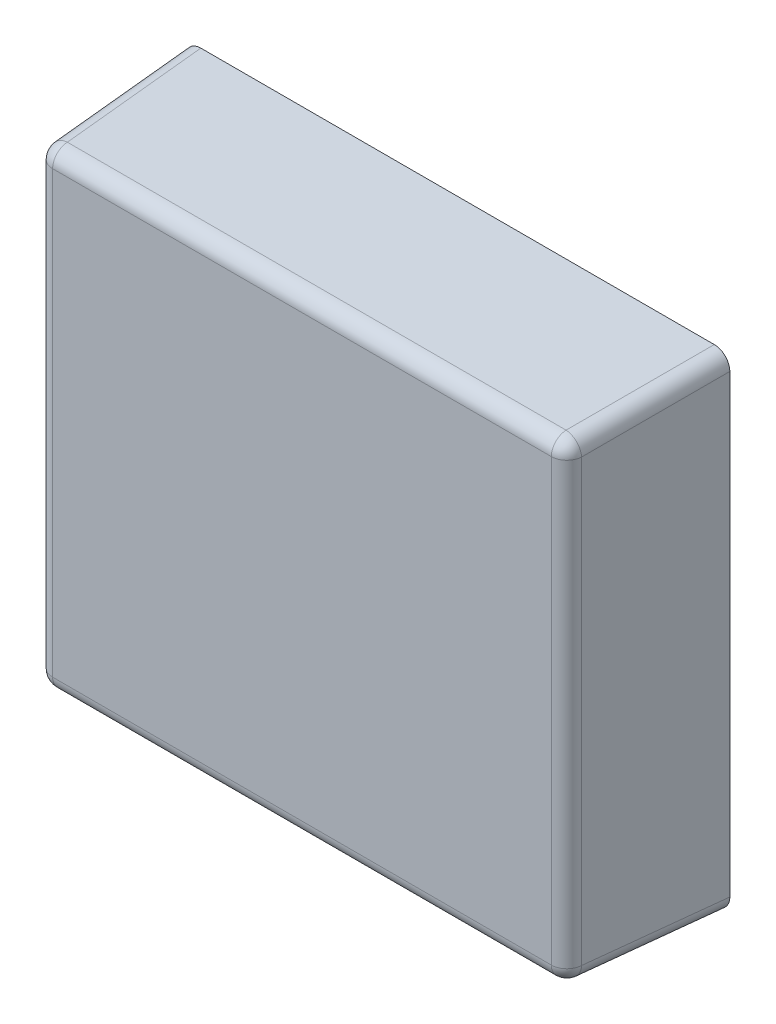
ISO-10303-21;
HEADER;
FILE_DESCRIPTION(('STEP AP214'),'2;1');
FILE_NAME('part.step','',(''),(''),'','','');
FILE_SCHEMA(('AUTOMOTIVE_DESIGN { 1 0 10303 214 1 1 1 1 }'));
ENDSEC;
DATA;
#1=APPLICATION_CONTEXT('core data for automotive mechanical design processes');
#2=APPLICATION_PROTOCOL_DEFINITION('international standard','automotive_design',2000,#1);
#3=PRODUCT_CONTEXT('',#1,'mechanical');
#4=PRODUCT('Part','Part','',(#3));
#5=PRODUCT_RELATED_PRODUCT_CATEGORY('part','',(#4));
#6=PRODUCT_DEFINITION_FORMATION('','',#4);
#7=PRODUCT_DEFINITION_CONTEXT('part definition',#1,'design');
#8=PRODUCT_DEFINITION('design','',#6,#7);
#9=PRODUCT_DEFINITION_SHAPE('','',#8);
#10=(LENGTH_UNIT() NAMED_UNIT(*) SI_UNIT(.MILLI.,.METRE.));
#11=(NAMED_UNIT(*) PLANE_ANGLE_UNIT() SI_UNIT($,.RADIAN.));
#12=(NAMED_UNIT(*) SI_UNIT($,.STERADIAN.) SOLID_ANGLE_UNIT());
#13=UNCERTAINTY_MEASURE_WITH_UNIT(LENGTH_MEASURE(1.E-05),#10,'distance_accuracy_value','');
#14=(GEOMETRIC_REPRESENTATION_CONTEXT(3) GLOBAL_UNCERTAINTY_ASSIGNED_CONTEXT((#13)) GLOBAL_UNIT_ASSIGNED_CONTEXT((#10,
#11,#12)) REPRESENTATION_CONTEXT('',''));
#15=CARTESIAN_POINT('',(0.,0.,0.));
#16=DIRECTION('',(0.,0.,1.));
#17=DIRECTION('',(1.,0.,0.));
#18=AXIS2_PLACEMENT_3D('',#15,#16,#17);
#19=CARTESIAN_POINT('',(-0.7,-0.625,0.4));
#20=DIRECTION('',(0.,0.,1.));
#21=DIRECTION('',(1.,0.,0.));
#22=AXIS2_PLACEMENT_3D('',#19,#20,#21);
#23=PLANE('',#22);
#24=DIRECTION('',(0.,1.,0.));
#25=VECTOR('',#24,1.);
#26=CARTESIAN_POINT('',(-0.641078305618,-0.625,0.4));
#27=LINE('',#26,#25);
#28=CARTESIAN_POINT('',(-0.641078305618,-0.566078305618,0.4));
#29=VERTEX_POINT('',#28);
#30=CARTESIAN_POINT('',(-0.641078305618,0.566078305618,0.4));
#31=VERTEX_POINT('',#30);
#32=EDGE_CURVE('E98',#29,#31,#27,.T.);
#33=ORIENTED_EDGE('',*,*,#32,.F.);
#34=DIRECTION('',(-1.,0.,0.));
#35=VECTOR('',#34,1.);
#36=CARTESIAN_POINT('',(-0.7,-0.566078305618,0.4));
#37=LINE('',#36,#35);
#38=CARTESIAN_POINT('',(0.641078305618,-0.566078305618,0.4));
#39=VERTEX_POINT('',#38);
#40=EDGE_CURVE('E100',#39,#29,#37,.T.);
#41=ORIENTED_EDGE('',*,*,#40,.F.);
#42=DIRECTION('',(0.,-1.,0.));
#43=VECTOR('',#42,1.);
#44=CARTESIAN_POINT('',(0.641078305618,-0.625,0.4));
#45=LINE('',#44,#43);
#46=CARTESIAN_POINT('',(0.641078305618,0.566078305618,0.4));
#47=VERTEX_POINT('',#46);
#48=EDGE_CURVE('E92',#47,#39,#45,.T.);
#49=ORIENTED_EDGE('',*,*,#48,.F.);
#50=DIRECTION('',(1.,0.,0.));
#51=VECTOR('',#50,1.);
#52=CARTESIAN_POINT('',(-0.7,0.566078305618,0.4));
#53=LINE('',#52,#51);
#54=EDGE_CURVE('E102',#31,#47,#53,.T.);
#55=ORIENTED_EDGE('',*,*,#54,.F.);
#56=EDGE_LOOP('',(#33,#41,#49,#55));
#57=FACE_BOUND('',#56,.T.);
#58=ADVANCED_FACE('F16',(#57),#23,.T.);
#59=CARTESIAN_POINT('',(-0.641078305618,0.566078305618,0.36));
#60=DIRECTION('',(1.,0.,0.));
#61=DIRECTION('',(0.,1.,0.));
#62=AXIS2_PLACEMENT_3D('',#59,#60,#61);
#63=SPHERICAL_SURFACE('',#62,0.04);
#64=CARTESIAN_POINT('',(-0.641078305618,0.566078305618,0.36));
#65=DIRECTION('',(0.,1.,0.));
#66=DIRECTION('',(0.,0.,1.));
#67=AXIS2_PLACEMENT_3D('',#64,#65,#66);
#68=CIRCLE('',#67,0.04);
#69=CARTESIAN_POINT('',(-0.681023487008266,0.566078305618001,0.362093438250014));
#70=VERTEX_POINT('',#69);
#71=EDGE_CURVE('E83',#31,#70,#68,.F.);
#72=ORIENTED_EDGE('',*,*,#71,.F.);
#73=CARTESIAN_POINT('',(-0.641078305618,0.566078305618,0.36));
#74=DIRECTION('',(1.,0.,0.));
#75=DIRECTION('',(0.,1.,0.));
#76=AXIS2_PLACEMENT_3D('',#73,#74,#75);
#77=CIRCLE('',#76,0.04);
#78=CARTESIAN_POINT('',(-0.641078305618,0.606023487008274,0.362093438250014));
#79=VERTEX_POINT('',#78);
#80=EDGE_CURVE('E152',#79,#31,#77,.T.);
#81=ORIENTED_EDGE('',*,*,#80,.F.);
#82=CARTESIAN_POINT('',(-0.641078305618197,0.566078305618197,0.360000000000312));
#83=DIRECTION('',(0.0522644276887224,-0.0522644276887224,0.997264688634236));
#84=DIRECTION('',(0.998629534754573,0.,-0.0523359562429523));
#85=AXIS2_PLACEMENT_3D('',#82,#83,#84);
#86=CIRCLE('',#85,0.04);
#87=EDGE_CURVE('E19',#70,#79,#86,.F.);
#88=ORIENTED_EDGE('',*,*,#87,.F.);
#89=EDGE_LOOP('',(#72,#81,#88));
#90=FACE_BOUND('',#89,.T.);
#91=ADVANCED_FACE('F141',(#90),#63,.T.);
#92=CARTESIAN_POINT('',(-0.641078305618,-0.625,0.36));
#93=DIRECTION('',(0.,1.,0.));
#94=DIRECTION('',(0.,0.,1.));
#95=AXIS2_PLACEMENT_3D('',#92,#93,#94);
#96=CYLINDRICAL_SURFACE('',#95,0.04);
#97=ORIENTED_EDGE('',*,*,#71,.T.);
#98=DIRECTION('',(0.,1.,0.));
#99=VECTOR('',#98,1.);
#100=CARTESIAN_POINT('',(-0.681023487008365,0.,0.362093438250019));
#101=LINE('',#100,#99);
#102=CARTESIAN_POINT('',(-0.681023487008335,-0.566078305618,0.362093438250017));
#103=VERTEX_POINT('',#102);
#104=EDGE_CURVE('E107',#103,#70,#101,.T.);
#105=ORIENTED_EDGE('',*,*,#104,.F.);
#106=CARTESIAN_POINT('',(-0.641078305618,-0.566078305618,0.36));
#107=DIRECTION('',(0.,-1.,0.));
#108=DIRECTION('',(1.,0.,0.));
#109=AXIS2_PLACEMENT_3D('',#106,#107,#108);
#110=CIRCLE('',#109,0.04);
#111=EDGE_CURVE('E105',#29,#103,#110,.T.);
#112=ORIENTED_EDGE('',*,*,#111,.F.);
#113=ORIENTED_EDGE('',*,*,#32,.T.);
#114=EDGE_LOOP('',(#97,#105,#112,#113));
#115=FACE_BOUND('',#114,.T.);
#116=ADVANCED_FACE('F106',(#115),#96,.T.);
#117=CARTESIAN_POINT('',(-0.641078305618,-0.566078305618,0.36));
#118=DIRECTION('',(1.,0.,0.));
#119=DIRECTION('',(0.,1.,0.));
#120=AXIS2_PLACEMENT_3D('',#117,#118,#119);
#121=SPHERICAL_SURFACE('',#120,0.04);
#122=CARTESIAN_POINT('',(-0.641078305618319,-0.566078305618319,0.360000000000325));
#123=DIRECTION('',(0.0522644276887224,0.0522644276887224,0.997264688634236));
#124=DIRECTION('',(0.998629534754573,0.,-0.0523359562429523));
#125=AXIS2_PLACEMENT_3D('',#122,#123,#124);
#126=CIRCLE('',#125,0.04);
#127=CARTESIAN_POINT('',(-0.641078305618002,-0.606023487008266,0.362093438250014));
#128=VERTEX_POINT('',#127);
#129=EDGE_CURVE('E122',#128,#103,#126,.F.);
#130=ORIENTED_EDGE('',*,*,#129,.F.);
#131=CARTESIAN_POINT('',(-0.641078305618,-0.566078305618,0.36));
#132=DIRECTION('',(-1.,0.,0.));
#133=DIRECTION('',(0.,-1.,0.));
#134=AXIS2_PLACEMENT_3D('',#131,#132,#133);
#135=CIRCLE('',#134,0.04);
#136=EDGE_CURVE('E113',#29,#128,#135,.F.);
#137=ORIENTED_EDGE('',*,*,#136,.F.);
#138=ORIENTED_EDGE('',*,*,#111,.T.);
#139=EDGE_LOOP('',(#130,#137,#138));
#140=FACE_BOUND('',#139,.T.);
#141=ADVANCED_FACE('F121',(#140),#121,.T.);
#142=CARTESIAN_POINT('',(-0.7,-0.566078305618,0.36));
#143=DIRECTION('',(-1.,0.,0.));
#144=DIRECTION('',(0.,-1.,0.));
#145=AXIS2_PLACEMENT_3D('',#142,#143,#144);
#146=CYLINDRICAL_SURFACE('',#145,0.04);
#147=CARTESIAN_POINT('',(0.641078305618,-0.566078305618,0.36));
#148=DIRECTION('',(1.,0.,0.));
#149=DIRECTION('',(0.,1.,0.));
#150=AXIS2_PLACEMENT_3D('',#147,#148,#149);
#151=CIRCLE('',#150,0.04);
#152=CARTESIAN_POINT('',(0.641078305618,-0.606023487008274,0.362093438250014));
#153=VERTEX_POINT('',#152);
#154=EDGE_CURVE('E119',#39,#153,#151,.T.);
#155=ORIENTED_EDGE('',*,*,#154,.F.);
#156=ORIENTED_EDGE('',*,*,#40,.T.);
#157=ORIENTED_EDGE('',*,*,#136,.T.);
#158=DIRECTION('',(1.,0.,0.));
#159=VECTOR('',#158,1.);
#160=CARTESIAN_POINT('',(0.,-0.606023487008365,0.362093438250019));
#161=LINE('',#160,#159);
#162=EDGE_CURVE('E194',#153,#128,#161,.F.);
#163=ORIENTED_EDGE('',*,*,#162,.F.);
#164=EDGE_LOOP('',(#155,#156,#157,#163));
#165=FACE_BOUND('',#164,.T.);
#166=ADVANCED_FACE('F116',(#165),#146,.T.);
#167=CARTESIAN_POINT('',(0.641078305618,-0.566078305618,0.36));
#168=DIRECTION('',(1.,0.,0.));
#169=DIRECTION('',(0.,1.,0.));
#170=AXIS2_PLACEMENT_3D('',#167,#168,#169);
#171=SPHERICAL_SURFACE('',#170,0.04);
#172=CARTESIAN_POINT('',(0.641078305618197,-0.566078305618197,0.360000000000312));
#173=DIRECTION('',(-0.0522644276887224,0.0522644276887224,0.997264688634236));
#174=DIRECTION('',(0.998629534754573,0.,0.0523359562429523));
#175=AXIS2_PLACEMENT_3D('',#172,#173,#174);
#176=CIRCLE('',#175,0.04);
#177=CARTESIAN_POINT('',(0.681023487008266,-0.566078305618002,0.362093438250014));
#178=VERTEX_POINT('',#177);
#179=EDGE_CURVE('E188',#178,#153,#176,.F.);
#180=ORIENTED_EDGE('',*,*,#179,.F.);
#181=CARTESIAN_POINT('',(0.641078305618,-0.566078305618,0.36));
#182=DIRECTION('',(0.,-1.,0.));
#183=DIRECTION('',(1.,0.,0.));
#184=AXIS2_PLACEMENT_3D('',#181,#182,#183);
#185=CIRCLE('',#184,0.04);
#186=EDGE_CURVE('E157',#39,#178,#185,.F.);
#187=ORIENTED_EDGE('',*,*,#186,.F.);
#188=ORIENTED_EDGE('',*,*,#154,.T.);
#189=EDGE_LOOP('',(#180,#187,#188));
#190=FACE_BOUND('',#189,.T.);
#191=ADVANCED_FACE('F225',(#190),#171,.T.);
#192=CARTESIAN_POINT('',(0.641078305618,-0.625,0.36));
#193=DIRECTION('',(0.,-1.,0.));
#194=DIRECTION('',(1.,0.,0.));
#195=AXIS2_PLACEMENT_3D('',#192,#193,#194);
#196=CYLINDRICAL_SURFACE('',#195,0.04);
#197=CARTESIAN_POINT('',(0.641078305618,0.566078305618,0.36));
#198=DIRECTION('',(0.,-1.,0.));
#199=DIRECTION('',(1.,0.,0.));
#200=AXIS2_PLACEMENT_3D('',#197,#198,#199);
#201=CIRCLE('',#200,0.04);
#202=CARTESIAN_POINT('',(0.681023487008335,0.566078305618159,0.362093438250026));
#203=VERTEX_POINT('',#202);
#204=EDGE_CURVE('E156',#47,#203,#201,.F.);
#205=ORIENTED_EDGE('',*,*,#204,.F.);
#206=ORIENTED_EDGE('',*,*,#48,.T.);
#207=ORIENTED_EDGE('',*,*,#186,.T.);
#208=DIRECTION('',(0.,1.,0.));
#209=VECTOR('',#208,1.);
#210=CARTESIAN_POINT('',(0.681023487008365,0.,0.362093438250019));
#211=LINE('',#210,#209);
#212=EDGE_CURVE('E187',#203,#178,#211,.F.);
#213=ORIENTED_EDGE('',*,*,#212,.F.);
#214=EDGE_LOOP('',(#205,#206,#207,#213));
#215=FACE_BOUND('',#214,.T.);
#216=ADVANCED_FACE('F221',(#215),#196,.T.);
#217=CARTESIAN_POINT('',(0.641078305618,0.566078305618,0.36));
#218=DIRECTION('',(1.,0.,0.));
#219=DIRECTION('',(0.,1.,0.));
#220=AXIS2_PLACEMENT_3D('',#217,#218,#219);
#221=SPHERICAL_SURFACE('',#220,0.04);
#222=ORIENTED_EDGE('',*,*,#204,.T.);
#223=CARTESIAN_POINT('',(0.641078305618319,0.566078305618319,0.360000000000325));
#224=DIRECTION('',(-0.0522644276887224,-0.0522644276887224,0.997264688634236));
#225=DIRECTION('',(0.998629534754573,0.,0.0523359562429523));
#226=AXIS2_PLACEMENT_3D('',#223,#224,#225);
#227=CIRCLE('',#226,0.04);
#228=CARTESIAN_POINT('',(0.641078305618002,0.606023487008266,0.362093438250014));
#229=VERTEX_POINT('',#228);
#230=EDGE_CURVE('E182',#229,#203,#227,.F.);
#231=ORIENTED_EDGE('',*,*,#230,.F.);
#232=CARTESIAN_POINT('',(0.641078305618,0.566078305618,0.36));
#233=DIRECTION('',(1.,0.,0.));
#234=DIRECTION('',(0.,1.,0.));
#235=AXIS2_PLACEMENT_3D('',#232,#233,#234);
#236=CIRCLE('',#235,0.04);
#237=EDGE_CURVE('E151',#47,#229,#236,.F.);
#238=ORIENTED_EDGE('',*,*,#237,.F.);
#239=EDGE_LOOP('',(#222,#231,#238));
#240=FACE_BOUND('',#239,.T.);
#241=ADVANCED_FACE('F216',(#240),#221,.T.);
#242=CARTESIAN_POINT('',(-0.7,0.566078305618,0.36));
#243=DIRECTION('',(1.,0.,0.));
#244=DIRECTION('',(0.,1.,0.));
#245=AXIS2_PLACEMENT_3D('',#242,#243,#244);
#246=CYLINDRICAL_SURFACE('',#245,0.04);
#247=ORIENTED_EDGE('',*,*,#237,.T.);
#248=DIRECTION('',(1.,0.,0.));
#249=VECTOR('',#248,1.);
#250=CARTESIAN_POINT('',(0.,0.606023487008365,0.362093438250019));
#251=LINE('',#250,#249);
#252=EDGE_CURVE('E181',#79,#229,#251,.T.);
#253=ORIENTED_EDGE('',*,*,#252,.F.);
#254=ORIENTED_EDGE('',*,*,#80,.T.);
#255=ORIENTED_EDGE('',*,*,#54,.T.);
#256=EDGE_LOOP('',(#247,#253,#254,#255));
#257=FACE_BOUND('',#256,.T.);
#258=ADVANCED_FACE('F220',(#257),#246,.T.);
#259=CARTESIAN_POINT('',(-0.658456700184,0.583456700184,0.02840047787701));
#260=DIRECTION('',(0.0522644276887224,-0.0522644276887224,0.997264688634236));
#261=DIRECTION('',(0.998629534754573,0.,-0.0523359562429523));
#262=AXIS2_PLACEMENT_3D('',#259,#260,#261);
#263=CYLINDRICAL_SURFACE('',#262,0.04);
#264=ORIENTED_EDGE('',*,*,#87,.T.);
#265=DIRECTION('',(0.0522644276896903,-0.0522644276886852,0.997264688634188));
#266=VECTOR('',#265,1.);
#267=CARTESIAN_POINT('',(-0.66005481861,0.625,0.));
#268=LINE('',#267,#266);
#269=CARTESIAN_POINT('',(-0.660054818609923,0.625000000000014,0.));
#270=VERTEX_POINT('',#269);
#271=EDGE_CURVE('E178',#270,#79,#268,.T.);
#272=ORIENTED_EDGE('',*,*,#271,.F.);
#273=CARTESIAN_POINT('',(-0.659945106160111,0.584945106160111,0.));
#274=DIRECTION('',(0.,0.,1.));
#275=DIRECTION('',(0.707106781186548,-0.707106781186548,0.));
#276=AXIS2_PLACEMENT_3D('',#273,#274,#275);
#277=ELLIPSE('',#276,0.0401097125526227,0.04);
#278=CARTESIAN_POINT('',(-0.700000000000014,0.585054818609923,0.));
#279=VERTEX_POINT('',#278);
#280=EDGE_CURVE('E175',#270,#279,#277,.T.);
#281=ORIENTED_EDGE('',*,*,#280,.T.);
#282=DIRECTION('',(-0.0522644276886852,0.0522644276896903,-0.997264688634188));
#283=VECTOR('',#282,1.);
#284=CARTESIAN_POINT('',(-0.681023487008365,0.566078305618,0.362093438250019));
#285=LINE('',#284,#283);
#286=EDGE_CURVE('E132',#70,#279,#285,.T.);
#287=ORIENTED_EDGE('',*,*,#286,.F.);
#288=EDGE_LOOP('',(#264,#272,#281,#287));
#289=FACE_BOUND('',#288,.T.);
#290=ADVANCED_FACE('F276',(#289),#263,.T.);
#291=CARTESIAN_POINT('',(-0.7,0.,0.));
#292=DIRECTION('',(-0.998629534754575,0.,0.0523359562429177));
#293=DIRECTION('',(0.0523359562429177,0.,0.998629534754575));
#294=AXIS2_PLACEMENT_3D('',#291,#292,#293);
#295=PLANE('',#294);
#296=DIRECTION('',(0.,1.,0.));
#297=VECTOR('',#296,1.);
#298=CARTESIAN_POINT('',(-0.7,-0.625,0.));
#299=LINE('',#298,#297);
#300=CARTESIAN_POINT('',(-0.700000000000113,-0.585054818609808,0.));
#301=VERTEX_POINT('',#300);
#302=EDGE_CURVE('E174',#279,#301,#299,.F.);
#303=ORIENTED_EDGE('',*,*,#302,.T.);
#304=DIRECTION('',(0.0522644276887224,0.0522644276887224,0.997264688634236));
#305=VECTOR('',#304,1.);
#306=CARTESIAN_POINT('',(-0.698197013794184,-0.583251832403681,0.0344030262421314));
#307=LINE('',#306,#305);
#308=EDGE_CURVE('E192',#103,#301,#307,.F.);
#309=ORIENTED_EDGE('',*,*,#308,.F.);
#310=ORIENTED_EDGE('',*,*,#104,.T.);
#311=ORIENTED_EDGE('',*,*,#286,.T.);
#312=EDGE_LOOP('',(#303,#309,#310,#311));
#313=FACE_BOUND('',#312,.T.);
#314=ADVANCED_FACE('F280',(#313),#295,.T.);
#315=CARTESIAN_POINT('',(-0.658251832404,-0.583251832404,0.03230958799243));
#316=DIRECTION('',(0.0522644276887224,0.0522644276887224,0.997264688634236));
#317=DIRECTION('',(0.998629534754573,0.,-0.0523359562429523));
#318=AXIS2_PLACEMENT_3D('',#315,#316,#317);
#319=CYLINDRICAL_SURFACE('',#318,0.04);
#320=CARTESIAN_POINT('',(-0.659945106160234,-0.584945106160234,0.));
#321=DIRECTION('',(0.,0.,1.));
#322=DIRECTION('',(0.707106781186548,0.707106781186548,0.));
#323=AXIS2_PLACEMENT_3D('',#320,#321,#322);
#324=ELLIPSE('',#323,0.0401097125526227,0.04);
#325=CARTESIAN_POINT('',(-0.660054818609984,-0.625000000000075,0.));
#326=VERTEX_POINT('',#325);
#327=EDGE_CURVE('E171',#301,#326,#324,.T.);
#328=ORIENTED_EDGE('',*,*,#327,.T.);
#329=DIRECTION('',(-0.0522644276896903,-0.0522644276886852,-0.997264688634188));
#330=VECTOR('',#329,1.);
#331=CARTESIAN_POINT('',(-0.641078305618,-0.606023487008365,0.362093438250019));
#332=LINE('',#331,#330);
#333=EDGE_CURVE('E191',#128,#326,#332,.T.);
#334=ORIENTED_EDGE('',*,*,#333,.F.);
#335=ORIENTED_EDGE('',*,*,#129,.T.);
#336=ORIENTED_EDGE('',*,*,#308,.T.);
#337=EDGE_LOOP('',(#328,#334,#335,#336));
#338=FACE_BOUND('',#337,.T.);
#339=ADVANCED_FACE('F286',(#338),#319,.T.);
#340=CARTESIAN_POINT('',(0.,-0.625,0.));
#341=DIRECTION('',(0.,-0.998629534754575,0.0523359562429177));
#342=DIRECTION('',(0.,-0.0523359562429177,-0.998629534754575));
#343=AXIS2_PLACEMENT_3D('',#340,#341,#342);
#344=PLANE('',#343);
#345=ORIENTED_EDGE('',*,*,#162,.T.);
#346=ORIENTED_EDGE('',*,*,#333,.T.);
#347=DIRECTION('',(1.,0.,0.));
#348=VECTOR('',#347,1.);
#349=CARTESIAN_POINT('',(-0.7,-0.625,0.));
#350=LINE('',#349,#348);
#351=CARTESIAN_POINT('',(0.660054818609747,-0.625000000000021,0.));
#352=VERTEX_POINT('',#351);
#353=EDGE_CURVE('E170',#326,#352,#350,.T.);
#354=ORIENTED_EDGE('',*,*,#353,.T.);
#355=DIRECTION('',(-0.0522644276887224,0.0522644276887224,0.997264688634236));
#356=VECTOR('',#355,1.);
#357=CARTESIAN_POINT('',(0.658456700183803,-0.623401881574183,0.0304939161267178));
#358=LINE('',#357,#356);
#359=EDGE_CURVE('E190',#153,#352,#358,.F.);
#360=ORIENTED_EDGE('',*,*,#359,.F.);
#361=EDGE_LOOP('',(#345,#346,#354,#360));
#362=FACE_BOUND('',#361,.T.);
#363=ADVANCED_FACE('F257',(#362),#344,.T.);
#364=CARTESIAN_POINT('',(0.658456700184,-0.583456700184,0.02840047787701));
#365=DIRECTION('',(-0.0522644276887224,0.0522644276887224,0.997264688634236));
#366=DIRECTION('',(0.998629534754573,0.,0.0523359562429523));
#367=AXIS2_PLACEMENT_3D('',#364,#365,#366);
#368=CYLINDRICAL_SURFACE('',#367,0.04);
#369=ORIENTED_EDGE('',*,*,#179,.T.);
#370=ORIENTED_EDGE('',*,*,#359,.T.);
#371=CARTESIAN_POINT('',(0.659945106160111,-0.584945106160111,0.));
#372=DIRECTION('',(0.,0.,1.));
#373=DIRECTION('',(-0.707106781186548,0.707106781186548,0.));
#374=AXIS2_PLACEMENT_3D('',#371,#372,#373);
#375=ELLIPSE('',#374,0.0401097125526227,0.04);
#376=CARTESIAN_POINT('',(0.700000000000014,-0.585054818609923,0.));
#377=VERTEX_POINT('',#376);
#378=EDGE_CURVE('E167',#352,#377,#375,.T.);
#379=ORIENTED_EDGE('',*,*,#378,.T.);
#380=DIRECTION('',(-0.0522644276886852,0.0522644276896903,0.997264688634188));
#381=VECTOR('',#380,1.);
#382=CARTESIAN_POINT('',(0.7,-0.58505481861,0.));
#383=LINE('',#382,#381);
#384=EDGE_CURVE('E185',#178,#377,#383,.F.);
#385=ORIENTED_EDGE('',*,*,#384,.F.);
#386=EDGE_LOOP('',(#369,#370,#379,#385));
#387=FACE_BOUND('',#386,.T.);
#388=ADVANCED_FACE('F247',(#387),#368,.T.);
#389=CARTESIAN_POINT('',(0.7,0.,0.));
#390=DIRECTION('',(0.998629534754575,0.,0.0523359562429177));
#391=DIRECTION('',(0.0523359562429177,0.,-0.998629534754575));
#392=AXIS2_PLACEMENT_3D('',#389,#390,#391);
#393=PLANE('',#392);
#394=ORIENTED_EDGE('',*,*,#212,.T.);
#395=ORIENTED_EDGE('',*,*,#384,.T.);
#396=DIRECTION('',(0.,1.,0.));
#397=VECTOR('',#396,1.);
#398=CARTESIAN_POINT('',(0.7,-0.625,0.));
#399=LINE('',#398,#397);
#400=CARTESIAN_POINT('',(0.700000000000075,0.585054818609967,0.));
#401=VERTEX_POINT('',#400);
#402=EDGE_CURVE('E166',#377,#401,#399,.T.);
#403=ORIENTED_EDGE('',*,*,#402,.T.);
#404=DIRECTION('',(0.0522644276886879,0.0522644276887223,-0.997264688634238));
#405=VECTOR('',#404,1.);
#406=CARTESIAN_POINT('',(0.681023487008364,0.566078305618319,0.362093438250036));
#407=LINE('',#406,#405);
#408=EDGE_CURVE('E179',#203,#401,#407,.T.);
#409=ORIENTED_EDGE('',*,*,#408,.F.);
#410=EDGE_LOOP('',(#394,#395,#403,#409));
#411=FACE_BOUND('',#410,.T.);
#412=ADVANCED_FACE('F242',(#411),#393,.T.);
#413=CARTESIAN_POINT('',(0.658251832404,0.583251832404,0.03230958799243));
#414=DIRECTION('',(-0.0522644276887224,-0.0522644276887224,0.997264688634236));
#415=DIRECTION('',(0.998629534754573,0.,0.0523359562429523));
#416=AXIS2_PLACEMENT_3D('',#413,#414,#415);
#417=CYLINDRICAL_SURFACE('',#416,0.04);
#418=CARTESIAN_POINT('',(0.659945106160234,0.584945106160234,0.));
#419=DIRECTION('',(0.,0.,1.));
#420=DIRECTION('',(-0.707106781186548,-0.707106781186548,0.));
#421=AXIS2_PLACEMENT_3D('',#418,#419,#420);
#422=ELLIPSE('',#421,0.0401097125526227,0.04);
#423=CARTESIAN_POINT('',(0.660054818609984,0.625000000000075,0.));
#424=VERTEX_POINT('',#423);
#425=EDGE_CURVE('E25',#401,#424,#422,.T.);
#426=ORIENTED_EDGE('',*,*,#425,.T.);
#427=DIRECTION('',(0.0522644276896903,0.0522644276886852,-0.997264688634188));
#428=VECTOR('',#427,1.);
#429=CARTESIAN_POINT('',(0.641078305618,0.606023487008365,0.362093438250019));
#430=LINE('',#429,#428);
#431=EDGE_CURVE('E33',#229,#424,#430,.T.);
#432=ORIENTED_EDGE('',*,*,#431,.F.);
#433=ORIENTED_EDGE('',*,*,#230,.T.);
#434=ORIENTED_EDGE('',*,*,#408,.T.);
#435=EDGE_LOOP('',(#426,#432,#433,#434));
#436=FACE_BOUND('',#435,.T.);
#437=ADVANCED_FACE('F275',(#436),#417,.T.);
#438=CARTESIAN_POINT('',(0.,0.625,0.));
#439=DIRECTION('',(0.,0.998629534754575,0.0523359562429177));
#440=DIRECTION('',(0.,-0.0523359562429177,0.998629534754575));
#441=AXIS2_PLACEMENT_3D('',#438,#439,#440);
#442=PLANE('',#441);
#443=DIRECTION('',(1.,0.,0.));
#444=VECTOR('',#443,1.);
#445=CARTESIAN_POINT('',(-0.7,0.625,0.));
#446=LINE('',#445,#444);
#447=EDGE_CURVE('E11',#424,#270,#446,.F.);
#448=ORIENTED_EDGE('',*,*,#447,.T.);
#449=ORIENTED_EDGE('',*,*,#271,.T.);
#450=ORIENTED_EDGE('',*,*,#252,.T.);
#451=ORIENTED_EDGE('',*,*,#431,.T.);
#452=EDGE_LOOP('',(#448,#449,#450,#451));
#453=FACE_BOUND('',#452,.T.);
#454=ADVANCED_FACE('F267',(#453),#442,.T.);
#455=CARTESIAN_POINT('',(-0.7,-0.625,0.));
#456=DIRECTION('',(0.,0.,1.));
#457=DIRECTION('',(1.,0.,0.));
#458=AXIS2_PLACEMENT_3D('',#455,#456,#457);
#459=PLANE('',#458);
#460=ORIENTED_EDGE('',*,*,#425,.F.);
#461=ORIENTED_EDGE('',*,*,#402,.F.);
#462=ORIENTED_EDGE('',*,*,#378,.F.);
#463=ORIENTED_EDGE('',*,*,#353,.F.);
#464=ORIENTED_EDGE('',*,*,#327,.F.);
#465=ORIENTED_EDGE('',*,*,#302,.F.);
#466=ORIENTED_EDGE('',*,*,#280,.F.);
#467=ORIENTED_EDGE('',*,*,#447,.F.);
#468=EDGE_LOOP('',(#460,#461,#462,#463,#464,#465,#466,#467));
#469=FACE_BOUND('',#468,.T.);
#470=ADVANCED_FACE('F254',(#469),#459,.F.);
#471=CLOSED_SHELL('',(#58,#91,#116,#141,#166,#191,#216,#241,#258,#290,#314,#339,#363,#388,#412,
#437,#454,#470));
#472=MANIFOLD_SOLID_BREP('B1',#471);
#473=ADVANCED_BREP_SHAPE_REPRESENTATION('',(#18,#472),#14);
#474=SHAPE_DEFINITION_REPRESENTATION(#9,#473);
ENDSEC;
END-ISO-10303-21;
